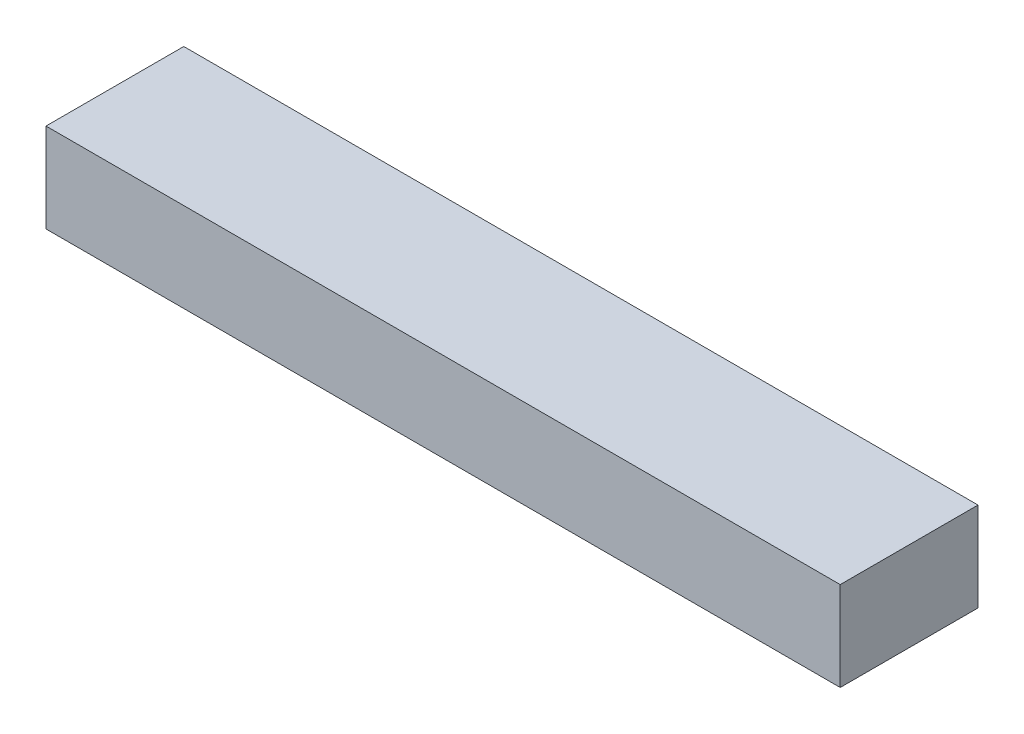
ISO-10303-21;
HEADER;
FILE_DESCRIPTION(('STEP AP214'),'2;1');
FILE_NAME('part.step','',(''),(''),'','','');
FILE_SCHEMA(('AUTOMOTIVE_DESIGN { 1 0 10303 214 1 1 1 1 }'));
ENDSEC;
DATA;
#1=APPLICATION_CONTEXT('core data for automotive mechanical design processes');
#2=APPLICATION_PROTOCOL_DEFINITION('international standard','automotive_design',2000,#1);
#3=PRODUCT_CONTEXT('',#1,'mechanical');
#4=PRODUCT('Part','Part','',(#3));
#5=PRODUCT_RELATED_PRODUCT_CATEGORY('part','',(#4));
#6=PRODUCT_DEFINITION_FORMATION('','',#4);
#7=PRODUCT_DEFINITION_CONTEXT('part definition',#1,'design');
#8=PRODUCT_DEFINITION('design','',#6,#7);
#9=PRODUCT_DEFINITION_SHAPE('','',#8);
#10=(LENGTH_UNIT() NAMED_UNIT(*) SI_UNIT(.MILLI.,.METRE.));
#11=(NAMED_UNIT(*) PLANE_ANGLE_UNIT() SI_UNIT($,.RADIAN.));
#12=(NAMED_UNIT(*) SI_UNIT($,.STERADIAN.) SOLID_ANGLE_UNIT());
#13=UNCERTAINTY_MEASURE_WITH_UNIT(LENGTH_MEASURE(1.E-05),#10,'distance_accuracy_value','');
#14=(GEOMETRIC_REPRESENTATION_CONTEXT(3) GLOBAL_UNCERTAINTY_ASSIGNED_CONTEXT((#13)) GLOBAL_UNIT_ASSIGNED_CONTEXT((#10,
#11,#12)) REPRESENTATION_CONTEXT('',''));
#15=CARTESIAN_POINT('',(0.,0.,0.));
#16=DIRECTION('',(0.,0.,1.));
#17=DIRECTION('',(1.,0.,0.));
#18=AXIS2_PLACEMENT_3D('',#15,#16,#17);
#19=CARTESIAN_POINT('',(0.,11.,0.));
#20=DIRECTION('',(-1.,0.,0.));
#21=DIRECTION('',(0.,0.,1.));
#22=AXIS2_PLACEMENT_3D('',#19,#20,#21);
#23=PLANE('',#22);
#24=DIRECTION('',(0.,0.,-1.));
#25=VECTOR('',#24,1.);
#26=CARTESIAN_POINT('',(0.,0.,0.));
#27=LINE('',#26,#25);
#28=CARTESIAN_POINT('',(0.,0.,17.));
#29=VERTEX_POINT('',#28);
#30=CARTESIAN_POINT('',(0.,0.,0.));
#31=VERTEX_POINT('',#30);
#32=EDGE_CURVE('E98',#29,#31,#27,.T.);
#33=ORIENTED_EDGE('',*,*,#32,.T.);
#34=DIRECTION('',(0.,-1.,0.));
#35=VECTOR('',#34,1.);
#36=CARTESIAN_POINT('',(0.,11.,0.));
#37=LINE('',#36,#35);
#38=CARTESIAN_POINT('',(0.,11.,0.));
#39=VERTEX_POINT('',#38);
#40=EDGE_CURVE('E11',#39,#31,#37,.T.);
#41=ORIENTED_EDGE('',*,*,#40,.F.);
#42=DIRECTION('',(0.,0.,-1.));
#43=VECTOR('',#42,1.);
#44=CARTESIAN_POINT('',(0.,11.,0.));
#45=LINE('',#44,#43);
#46=CARTESIAN_POINT('',(0.,11.,17.));
#47=VERTEX_POINT('',#46);
#48=EDGE_CURVE('E86',#47,#39,#45,.T.);
#49=ORIENTED_EDGE('',*,*,#48,.F.);
#50=DIRECTION('',(0.,-1.,0.));
#51=VECTOR('',#50,1.);
#52=CARTESIAN_POINT('',(0.,11.,17.));
#53=LINE('',#52,#51);
#54=EDGE_CURVE('E94',#47,#29,#53,.T.);
#55=ORIENTED_EDGE('',*,*,#54,.T.);
#56=EDGE_LOOP('',(#33,#41,#49,#55));
#57=FACE_BOUND('',#56,.T.);
#58=ADVANCED_FACE('F35',(#57),#23,.F.);
#59=CARTESIAN_POINT('',(0.,11.,0.));
#60=DIRECTION('',(0.,0.,1.));
#61=DIRECTION('',(1.,0.,0.));
#62=AXIS2_PLACEMENT_3D('',#59,#60,#61);
#63=PLANE('',#62);
#64=DIRECTION('',(-1.,0.,0.));
#65=VECTOR('',#64,1.);
#66=CARTESIAN_POINT('',(0.,0.,0.));
#67=LINE('',#66,#65);
#68=CARTESIAN_POINT('',(-98.,0.,0.));
#69=VERTEX_POINT('',#68);
#70=EDGE_CURVE('E90',#31,#69,#67,.T.);
#71=ORIENTED_EDGE('',*,*,#70,.T.);
#72=DIRECTION('',(0.,-1.,0.));
#73=VECTOR('',#72,1.);
#74=CARTESIAN_POINT('',(-98.,11.,0.));
#75=LINE('',#74,#73);
#76=CARTESIAN_POINT('',(-98.,11.,0.));
#77=VERTEX_POINT('',#76);
#78=EDGE_CURVE('E43',#77,#69,#75,.T.);
#79=ORIENTED_EDGE('',*,*,#78,.F.);
#80=DIRECTION('',(-1.,0.,0.));
#81=VECTOR('',#80,1.);
#82=CARTESIAN_POINT('',(0.,11.,0.));
#83=LINE('',#82,#81);
#84=EDGE_CURVE('E81',#39,#77,#83,.T.);
#85=ORIENTED_EDGE('',*,*,#84,.F.);
#86=ORIENTED_EDGE('',*,*,#40,.T.);
#87=EDGE_LOOP('',(#71,#79,#85,#86));
#88=FACE_BOUND('',#87,.T.);
#89=ADVANCED_FACE('F89',(#88),#63,.F.);
#90=CARTESIAN_POINT('',(-98.,11.,0.));
#91=DIRECTION('',(1.,0.,0.));
#92=DIRECTION('',(0.,0.,-1.));
#93=AXIS2_PLACEMENT_3D('',#90,#91,#92);
#94=PLANE('',#93);
#95=DIRECTION('',(0.,0.,1.));
#96=VECTOR('',#95,1.);
#97=CARTESIAN_POINT('',(-98.,0.,0.));
#98=LINE('',#97,#96);
#99=CARTESIAN_POINT('',(-98.,0.,17.));
#100=VERTEX_POINT('',#99);
#101=EDGE_CURVE('E68',#69,#100,#98,.T.);
#102=ORIENTED_EDGE('',*,*,#101,.T.);
#103=DIRECTION('',(0.,-1.,0.));
#104=VECTOR('',#103,1.);
#105=CARTESIAN_POINT('',(-98.,11.,17.));
#106=LINE('',#105,#104);
#107=CARTESIAN_POINT('',(-98.,11.,17.));
#108=VERTEX_POINT('',#107);
#109=EDGE_CURVE('E91',#108,#100,#106,.T.);
#110=ORIENTED_EDGE('',*,*,#109,.F.);
#111=DIRECTION('',(0.,0.,1.));
#112=VECTOR('',#111,1.);
#113=CARTESIAN_POINT('',(-98.,11.,0.));
#114=LINE('',#113,#112);
#115=EDGE_CURVE('E84',#77,#108,#114,.T.);
#116=ORIENTED_EDGE('',*,*,#115,.F.);
#117=ORIENTED_EDGE('',*,*,#78,.T.);
#118=EDGE_LOOP('',(#102,#110,#116,#117));
#119=FACE_BOUND('',#118,.T.);
#120=ADVANCED_FACE('F92',(#119),#94,.F.);
#121=CARTESIAN_POINT('',(0.,11.,17.));
#122=DIRECTION('',(0.,0.,-1.));
#123=DIRECTION('',(-1.,0.,0.));
#124=AXIS2_PLACEMENT_3D('',#121,#122,#123);
#125=PLANE('',#124);
#126=DIRECTION('',(1.,0.,0.));
#127=VECTOR('',#126,1.);
#128=CARTESIAN_POINT('',(0.,0.,17.));
#129=LINE('',#128,#127);
#130=EDGE_CURVE('E74',#100,#29,#129,.T.);
#131=ORIENTED_EDGE('',*,*,#130,.T.);
#132=ORIENTED_EDGE('',*,*,#54,.F.);
#133=DIRECTION('',(1.,0.,0.));
#134=VECTOR('',#133,1.);
#135=CARTESIAN_POINT('',(0.,11.,17.));
#136=LINE('',#135,#134);
#137=EDGE_CURVE('E51',#108,#47,#136,.T.);
#138=ORIENTED_EDGE('',*,*,#137,.F.);
#139=ORIENTED_EDGE('',*,*,#109,.T.);
#140=EDGE_LOOP('',(#131,#132,#138,#139));
#141=FACE_BOUND('',#140,.T.);
#142=ADVANCED_FACE('F105',(#141),#125,.F.);
#143=CARTESIAN_POINT('',(0.,11.,0.));
#144=DIRECTION('',(0.,-1.,0.));
#145=DIRECTION('',(0.,0.,-1.));
#146=AXIS2_PLACEMENT_3D('',#143,#144,#145);
#147=PLANE('',#146);
#148=ORIENTED_EDGE('',*,*,#48,.T.);
#149=ORIENTED_EDGE('',*,*,#84,.T.);
#150=ORIENTED_EDGE('',*,*,#115,.T.);
#151=ORIENTED_EDGE('',*,*,#137,.T.);
#152=EDGE_LOOP('',(#148,#149,#150,#151));
#153=FACE_BOUND('',#152,.T.);
#154=ADVANCED_FACE('F82',(#153),#147,.F.);
#155=CARTESIAN_POINT('',(0.,0.,0.));
#156=DIRECTION('',(0.,-1.,0.));
#157=DIRECTION('',(0.,0.,-1.));
#158=AXIS2_PLACEMENT_3D('',#155,#156,#157);
#159=PLANE('',#158);
#160=ORIENTED_EDGE('',*,*,#32,.F.);
#161=ORIENTED_EDGE('',*,*,#130,.F.);
#162=ORIENTED_EDGE('',*,*,#101,.F.);
#163=ORIENTED_EDGE('',*,*,#70,.F.);
#164=EDGE_LOOP('',(#160,#161,#162,#163));
#165=FACE_BOUND('',#164,.T.);
#166=ADVANCED_FACE('F108',(#165),#159,.T.);
#167=CLOSED_SHELL('',(#58,#89,#120,#142,#154,#166));
#168=MANIFOLD_SOLID_BREP('B2',#167);
#169=ADVANCED_BREP_SHAPE_REPRESENTATION('',(#18,#168),#14);
#170=SHAPE_DEFINITION_REPRESENTATION(#9,#169);
ENDSEC;
END-ISO-10303-21;
